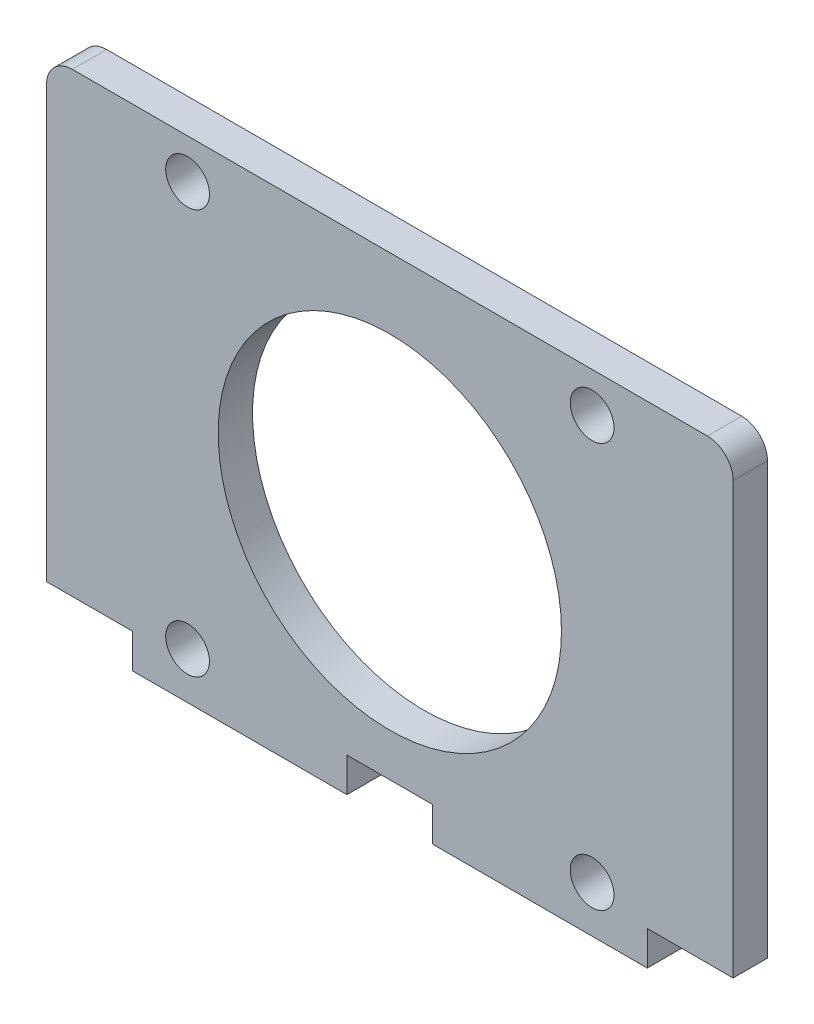
ISO-10303-21;
HEADER;
FILE_DESCRIPTION(('STEP AP214'),'2;1');
FILE_NAME('part.step','',(''),(''),'','','');
FILE_SCHEMA(('AUTOMOTIVE_DESIGN { 1 0 10303 214 1 1 1 1 }'));
ENDSEC;
DATA;
#1=APPLICATION_CONTEXT('core data for automotive mechanical design processes');
#2=APPLICATION_PROTOCOL_DEFINITION('international standard','automotive_design',2000,#1);
#3=PRODUCT_CONTEXT('',#1,'mechanical');
#4=PRODUCT('Part','Part','',(#3));
#5=PRODUCT_RELATED_PRODUCT_CATEGORY('part','',(#4));
#6=PRODUCT_DEFINITION_FORMATION('','',#4);
#7=PRODUCT_DEFINITION_CONTEXT('part definition',#1,'design');
#8=PRODUCT_DEFINITION('design','',#6,#7);
#9=PRODUCT_DEFINITION_SHAPE('','',#8);
#10=(LENGTH_UNIT() NAMED_UNIT(*) SI_UNIT(.MILLI.,.METRE.));
#11=(NAMED_UNIT(*) PLANE_ANGLE_UNIT() SI_UNIT($,.RADIAN.));
#12=(NAMED_UNIT(*) SI_UNIT($,.STERADIAN.) SOLID_ANGLE_UNIT());
#13=UNCERTAINTY_MEASURE_WITH_UNIT(LENGTH_MEASURE(1.E-05),#10,'distance_accuracy_value','');
#14=(GEOMETRIC_REPRESENTATION_CONTEXT(3) GLOBAL_UNCERTAINTY_ASSIGNED_CONTEXT((#13)) GLOBAL_UNIT_ASSIGNED_CONTEXT((#10,
#11,#12)) REPRESENTATION_CONTEXT('',''));
#15=CARTESIAN_POINT('',(0.,0.,0.));
#16=DIRECTION('',(0.,0.,1.));
#17=DIRECTION('',(1.,0.,0.));
#18=AXIS2_PLACEMENT_3D('',#15,#16,#17);
#19=CARTESIAN_POINT('',(0.,0.,4.));
#20=DIRECTION('',(0.,0.,1.));
#21=DIRECTION('',(1.,0.,0.));
#22=AXIS2_PLACEMENT_3D('',#19,#20,#21);
#23=PLANE('',#22);
#24=CARTESIAN_POINT('',(-23.5700000000001,-51.7699999999999,4.));
#25=DIRECTION('',(0.,0.,1.));
#26=DIRECTION('',(1.,0.,0.));
#27=AXIS2_PLACEMENT_3D('',#24,#25,#26);
#28=CIRCLE('',#27,2.55);
#29=CARTESIAN_POINT('',(-21.0200000000001,-51.7699999999999,4.));
#30=VERTEX_POINT('',#29);
#31=EDGE_CURVE('E484',#30,#30,#28,.T.);
#32=ORIENTED_EDGE('',*,*,#31,.F.);
#33=EDGE_LOOP('',(#32));
#34=FACE_BOUND('',#33,.T.);
#35=CARTESIAN_POINT('',(23.5700000000001,-4.63000000000012,4.));
#36=DIRECTION('',(0.,0.,1.));
#37=DIRECTION('',(1.,0.,0.));
#38=AXIS2_PLACEMENT_3D('',#35,#36,#37);
#39=CIRCLE('',#38,2.55);
#40=CARTESIAN_POINT('',(26.1200000000001,-4.63000000000012,4.));
#41=VERTEX_POINT('',#40);
#42=EDGE_CURVE('E496',#41,#41,#39,.T.);
#43=ORIENTED_EDGE('',*,*,#42,.F.);
#44=EDGE_LOOP('',(#43));
#45=FACE_BOUND('',#44,.T.);
#46=DIRECTION('',(-1.,0.,0.));
#47=VECTOR('',#46,1.);
#48=CARTESIAN_POINT('',(-40.,0.,4.));
#49=LINE('',#48,#47);
#50=CARTESIAN_POINT('',(37.,0.,4.));
#51=VERTEX_POINT('',#50);
#52=CARTESIAN_POINT('',(-37.,0.,4.));
#53=VERTEX_POINT('',#52);
#54=EDGE_CURVE('E179',#51,#53,#49,.T.);
#55=ORIENTED_EDGE('',*,*,#54,.T.);
#56=CARTESIAN_POINT('',(-37.,-3.,4.));
#57=DIRECTION('',(0.,0.,1.));
#58=DIRECTION('',(1.,0.,0.));
#59=AXIS2_PLACEMENT_3D('',#56,#57,#58);
#60=CIRCLE('',#59,3.);
#61=CARTESIAN_POINT('',(-40.,-3.,4.));
#62=VERTEX_POINT('',#61);
#63=EDGE_CURVE('E43',#53,#62,#60,.T.);
#64=ORIENTED_EDGE('',*,*,#63,.T.);
#65=DIRECTION('',(0.,-1.,0.));
#66=VECTOR('',#65,1.);
#67=CARTESIAN_POINT('',(-40.,0.,4.));
#68=LINE('',#67,#66);
#69=CARTESIAN_POINT('',(-40.,-53.2,4.));
#70=VERTEX_POINT('',#69);
#71=EDGE_CURVE('E137',#62,#70,#68,.T.);
#72=ORIENTED_EDGE('',*,*,#71,.T.);
#73=DIRECTION('',(1.,0.,0.));
#74=VECTOR('',#73,1.);
#75=CARTESIAN_POINT('',(-40.,-53.2,4.));
#76=LINE('',#75,#74);
#77=CARTESIAN_POINT('',(-30.,-53.2,4.));
#78=VERTEX_POINT('',#77);
#79=EDGE_CURVE('E140',#70,#78,#76,.T.);
#80=ORIENTED_EDGE('',*,*,#79,.T.);
#81=DIRECTION('',(0.,-1.,0.));
#82=VECTOR('',#81,1.);
#83=CARTESIAN_POINT('',(-30.,-53.2,4.));
#84=LINE('',#83,#82);
#85=CARTESIAN_POINT('',(-30.,-57.2,4.));
#86=VERTEX_POINT('',#85);
#87=EDGE_CURVE('E156',#78,#86,#84,.T.);
#88=ORIENTED_EDGE('',*,*,#87,.T.);
#89=DIRECTION('',(1.,0.,0.));
#90=VECTOR('',#89,1.);
#91=CARTESIAN_POINT('',(-30.,-57.2,4.));
#92=LINE('',#91,#90);
#93=CARTESIAN_POINT('',(-5.,-57.2,4.));
#94=VERTEX_POINT('',#93);
#95=EDGE_CURVE('E229',#86,#94,#92,.T.);
#96=ORIENTED_EDGE('',*,*,#95,.T.);
#97=DIRECTION('',(0.,1.,0.));
#98=VECTOR('',#97,1.);
#99=CARTESIAN_POINT('',(-5.,-57.2,4.));
#100=LINE('',#99,#98);
#101=CARTESIAN_POINT('',(-5.,-53.2,4.));
#102=VERTEX_POINT('',#101);
#103=EDGE_CURVE('E268',#94,#102,#100,.T.);
#104=ORIENTED_EDGE('',*,*,#103,.T.);
#105=DIRECTION('',(1.,0.,0.));
#106=VECTOR('',#105,1.);
#107=CARTESIAN_POINT('',(-5.,-53.2,4.));
#108=LINE('',#107,#106);
#109=CARTESIAN_POINT('',(5.,-53.2,4.));
#110=VERTEX_POINT('',#109);
#111=EDGE_CURVE('E272',#102,#110,#108,.T.);
#112=ORIENTED_EDGE('',*,*,#111,.T.);
#113=DIRECTION('',(0.,-1.,0.));
#114=VECTOR('',#113,1.);
#115=CARTESIAN_POINT('',(5.,-53.2,4.));
#116=LINE('',#115,#114);
#117=CARTESIAN_POINT('',(5.,-57.2,4.));
#118=VERTEX_POINT('',#117);
#119=EDGE_CURVE('E274',#110,#118,#116,.T.);
#120=ORIENTED_EDGE('',*,*,#119,.T.);
#121=DIRECTION('',(1.,0.,0.));
#122=VECTOR('',#121,1.);
#123=CARTESIAN_POINT('',(5.,-57.2,4.));
#124=LINE('',#123,#122);
#125=CARTESIAN_POINT('',(30.,-57.2,4.));
#126=VERTEX_POINT('',#125);
#127=EDGE_CURVE('E261',#118,#126,#124,.T.);
#128=ORIENTED_EDGE('',*,*,#127,.T.);
#129=DIRECTION('',(0.,1.,0.));
#130=VECTOR('',#129,1.);
#131=CARTESIAN_POINT('',(30.,-57.2,4.));
#132=LINE('',#131,#130);
#133=CARTESIAN_POINT('',(30.,-53.2,4.));
#134=VERTEX_POINT('',#133);
#135=EDGE_CURVE('E258',#126,#134,#132,.T.);
#136=ORIENTED_EDGE('',*,*,#135,.T.);
#137=DIRECTION('',(1.,0.,0.));
#138=VECTOR('',#137,1.);
#139=CARTESIAN_POINT('',(30.,-53.2,4.));
#140=LINE('',#139,#138);
#141=CARTESIAN_POINT('',(40.,-53.2,4.));
#142=VERTEX_POINT('',#141);
#143=EDGE_CURVE('E257',#134,#142,#140,.T.);
#144=ORIENTED_EDGE('',*,*,#143,.T.);
#145=DIRECTION('',(0.,1.,0.));
#146=VECTOR('',#145,1.);
#147=CARTESIAN_POINT('',(40.,-53.2,4.));
#148=LINE('',#147,#146);
#149=CARTESIAN_POINT('',(40.,-3.,4.));
#150=VERTEX_POINT('',#149);
#151=EDGE_CURVE('E180',#142,#150,#148,.T.);
#152=ORIENTED_EDGE('',*,*,#151,.T.);
#153=CARTESIAN_POINT('',(37.,-3.,4.));
#154=DIRECTION('',(0.,0.,1.));
#155=DIRECTION('',(1.,0.,0.));
#156=AXIS2_PLACEMENT_3D('',#153,#154,#155);
#157=CIRCLE('',#156,3.);
#158=EDGE_CURVE('E177',#150,#51,#157,.T.);
#159=ORIENTED_EDGE('',*,*,#158,.T.);
#160=EDGE_LOOP('',(#55,#64,#72,#80,#88,#96,#104,#112,#120,#128,#136,#144,#152,#159));
#161=FACE_BOUND('',#160,.T.);
#162=CARTESIAN_POINT('',(-23.5699999999999,-4.62999999999987,4.));
#163=DIRECTION('',(0.,0.,1.));
#164=DIRECTION('',(1.,0.,0.));
#165=AXIS2_PLACEMENT_3D('',#162,#163,#164);
#166=CIRCLE('',#165,2.55);
#167=CARTESIAN_POINT('',(-21.0199999999999,-4.62999999999987,4.));
#168=VERTEX_POINT('',#167);
#169=EDGE_CURVE('E265',#168,#168,#166,.T.);
#170=ORIENTED_EDGE('',*,*,#169,.F.);
#171=EDGE_LOOP('',(#170));
#172=FACE_BOUND('',#171,.T.);
#173=CARTESIAN_POINT('',(23.5699999999999,-51.7700000000001,4.));
#174=DIRECTION('',(0.,0.,1.));
#175=DIRECTION('',(1.,0.,0.));
#176=AXIS2_PLACEMENT_3D('',#173,#174,#175);
#177=CIRCLE('',#176,2.55);
#178=CARTESIAN_POINT('',(26.1199999999999,-51.7700000000001,4.));
#179=VERTEX_POINT('',#178);
#180=EDGE_CURVE('E490',#179,#179,#177,.T.);
#181=ORIENTED_EDGE('',*,*,#180,.F.);
#182=EDGE_LOOP('',(#181));
#183=FACE_BOUND('',#182,.T.);
#184=CARTESIAN_POINT('',(0.,-28.2,4.));
#185=DIRECTION('',(0.,0.,1.));
#186=DIRECTION('',(1.,0.,0.));
#187=AXIS2_PLACEMENT_3D('',#184,#185,#186);
#188=CIRCLE('',#187,20.);
#189=CARTESIAN_POINT('',(20.,-28.2,4.));
#190=VERTEX_POINT('',#189);
#191=EDGE_CURVE('E475',#190,#190,#188,.T.);
#192=ORIENTED_EDGE('',*,*,#191,.F.);
#193=EDGE_LOOP('',(#192));
#194=FACE_BOUND('',#193,.T.);
#195=ADVANCED_FACE('F35',(#34,#45,#161,#172,#183,#194),#23,.T.);
#196=CARTESIAN_POINT('',(0.,0.,0.));
#197=DIRECTION('',(0.,0.,1.));
#198=DIRECTION('',(1.,0.,0.));
#199=AXIS2_PLACEMENT_3D('',#196,#197,#198);
#200=PLANE('',#199);
#201=DIRECTION('',(0.,-1.,0.));
#202=VECTOR('',#201,1.);
#203=CARTESIAN_POINT('',(-40.,0.,0.));
#204=LINE('',#203,#202);
#205=CARTESIAN_POINT('',(-40.,-3.,0.));
#206=VERTEX_POINT('',#205);
#207=CARTESIAN_POINT('',(-40.,-53.2,0.));
#208=VERTEX_POINT('',#207);
#209=EDGE_CURVE('E160',#206,#208,#204,.T.);
#210=ORIENTED_EDGE('',*,*,#209,.F.);
#211=CARTESIAN_POINT('',(-37.,-3.,0.));
#212=DIRECTION('',(0.,0.,1.));
#213=DIRECTION('',(1.,0.,0.));
#214=AXIS2_PLACEMENT_3D('',#211,#212,#213);
#215=CIRCLE('',#214,3.);
#216=CARTESIAN_POINT('',(-37.,0.,0.));
#217=VERTEX_POINT('',#216);
#218=EDGE_CURVE('E171',#206,#217,#215,.F.);
#219=ORIENTED_EDGE('',*,*,#218,.T.);
#220=DIRECTION('',(-1.,0.,0.));
#221=VECTOR('',#220,1.);
#222=CARTESIAN_POINT('',(-40.,0.,0.));
#223=LINE('',#222,#221);
#224=CARTESIAN_POINT('',(37.,0.,0.));
#225=VERTEX_POINT('',#224);
#226=EDGE_CURVE('E147',#225,#217,#223,.T.);
#227=ORIENTED_EDGE('',*,*,#226,.F.);
#228=CARTESIAN_POINT('',(37.,-3.,0.));
#229=DIRECTION('',(0.,0.,1.));
#230=DIRECTION('',(1.,0.,0.));
#231=AXIS2_PLACEMENT_3D('',#228,#229,#230);
#232=CIRCLE('',#231,3.);
#233=CARTESIAN_POINT('',(40.,-3.,0.));
#234=VERTEX_POINT('',#233);
#235=EDGE_CURVE('E164',#225,#234,#232,.F.);
#236=ORIENTED_EDGE('',*,*,#235,.T.);
#237=DIRECTION('',(0.,1.,0.));
#238=VECTOR('',#237,1.);
#239=CARTESIAN_POINT('',(40.,-53.2,0.));
#240=LINE('',#239,#238);
#241=CARTESIAN_POINT('',(40.,-53.2,0.));
#242=VERTEX_POINT('',#241);
#243=EDGE_CURVE('E192',#242,#234,#240,.T.);
#244=ORIENTED_EDGE('',*,*,#243,.F.);
#245=DIRECTION('',(1.,0.,0.));
#246=VECTOR('',#245,1.);
#247=CARTESIAN_POINT('',(30.,-53.2,0.));
#248=LINE('',#247,#246);
#249=CARTESIAN_POINT('',(30.,-53.2,0.));
#250=VERTEX_POINT('',#249);
#251=EDGE_CURVE('E196',#250,#242,#248,.T.);
#252=ORIENTED_EDGE('',*,*,#251,.F.);
#253=DIRECTION('',(0.,1.,0.));
#254=VECTOR('',#253,1.);
#255=CARTESIAN_POINT('',(30.,-57.2,0.));
#256=LINE('',#255,#254);
#257=CARTESIAN_POINT('',(30.,-57.2,0.));
#258=VERTEX_POINT('',#257);
#259=EDGE_CURVE('E199',#258,#250,#256,.T.);
#260=ORIENTED_EDGE('',*,*,#259,.F.);
#261=DIRECTION('',(1.,0.,0.));
#262=VECTOR('',#261,1.);
#263=CARTESIAN_POINT('',(5.,-57.2,0.));
#264=LINE('',#263,#262);
#265=CARTESIAN_POINT('',(5.,-57.2,0.));
#266=VERTEX_POINT('',#265);
#267=EDGE_CURVE('E246',#266,#258,#264,.T.);
#268=ORIENTED_EDGE('',*,*,#267,.F.);
#269=DIRECTION('',(0.,-1.,0.));
#270=VECTOR('',#269,1.);
#271=CARTESIAN_POINT('',(5.,-53.2,0.));
#272=LINE('',#271,#270);
#273=CARTESIAN_POINT('',(5.,-53.2,0.));
#274=VERTEX_POINT('',#273);
#275=EDGE_CURVE('E244',#274,#266,#272,.T.);
#276=ORIENTED_EDGE('',*,*,#275,.F.);
#277=DIRECTION('',(1.,0.,0.));
#278=VECTOR('',#277,1.);
#279=CARTESIAN_POINT('',(-5.,-53.2,0.));
#280=LINE('',#279,#278);
#281=CARTESIAN_POINT('',(-5.,-53.2,0.));
#282=VERTEX_POINT('',#281);
#283=EDGE_CURVE('E237',#282,#274,#280,.T.);
#284=ORIENTED_EDGE('',*,*,#283,.F.);
#285=DIRECTION('',(0.,1.,0.));
#286=VECTOR('',#285,1.);
#287=CARTESIAN_POINT('',(-5.,-57.2,0.));
#288=LINE('',#287,#286);
#289=CARTESIAN_POINT('',(-5.,-57.2,0.));
#290=VERTEX_POINT('',#289);
#291=EDGE_CURVE('E235',#290,#282,#288,.T.);
#292=ORIENTED_EDGE('',*,*,#291,.F.);
#293=DIRECTION('',(1.,0.,0.));
#294=VECTOR('',#293,1.);
#295=CARTESIAN_POINT('',(-30.,-57.2,0.));
#296=LINE('',#295,#294);
#297=CARTESIAN_POINT('',(-30.,-57.2,0.));
#298=VERTEX_POINT('',#297);
#299=EDGE_CURVE('E228',#298,#290,#296,.T.);
#300=ORIENTED_EDGE('',*,*,#299,.F.);
#301=DIRECTION('',(0.,-1.,0.));
#302=VECTOR('',#301,1.);
#303=CARTESIAN_POINT('',(-30.,-53.2,0.));
#304=LINE('',#303,#302);
#305=CARTESIAN_POINT('',(-30.,-53.2,0.));
#306=VERTEX_POINT('',#305);
#307=EDGE_CURVE('E233',#306,#298,#304,.T.);
#308=ORIENTED_EDGE('',*,*,#307,.F.);
#309=DIRECTION('',(1.,0.,0.));
#310=VECTOR('',#309,1.);
#311=CARTESIAN_POINT('',(-40.,-53.2,0.));
#312=LINE('',#311,#310);
#313=EDGE_CURVE('E239',#208,#306,#312,.T.);
#314=ORIENTED_EDGE('',*,*,#313,.F.);
#315=EDGE_LOOP('',(#210,#219,#227,#236,#244,#252,#260,#268,#276,#284,#292,#300,#308,#314));
#316=FACE_BOUND('',#315,.T.);
#317=CARTESIAN_POINT('',(-23.5699999999999,-4.62999999999987,0.));
#318=DIRECTION('',(0.,0.,1.));
#319=DIRECTION('',(1.,0.,0.));
#320=AXIS2_PLACEMENT_3D('',#317,#318,#319);
#321=CIRCLE('',#320,2.55);
#322=CARTESIAN_POINT('',(-21.0199999999999,-4.62999999999987,0.));
#323=VERTEX_POINT('',#322);
#324=EDGE_CURVE('E499',#323,#323,#321,.T.);
#325=ORIENTED_EDGE('',*,*,#324,.T.);
#326=EDGE_LOOP('',(#325));
#327=FACE_BOUND('',#326,.T.);
#328=CARTESIAN_POINT('',(23.5700000000001,-4.63000000000012,0.));
#329=DIRECTION('',(0.,0.,1.));
#330=DIRECTION('',(1.,0.,0.));
#331=AXIS2_PLACEMENT_3D('',#328,#329,#330);
#332=CIRCLE('',#331,2.55);
#333=CARTESIAN_POINT('',(26.1200000000001,-4.63000000000012,0.));
#334=VERTEX_POINT('',#333);
#335=EDGE_CURVE('E493',#334,#334,#332,.T.);
#336=ORIENTED_EDGE('',*,*,#335,.T.);
#337=EDGE_LOOP('',(#336));
#338=FACE_BOUND('',#337,.T.);
#339=CARTESIAN_POINT('',(23.5699999999999,-51.7700000000001,0.));
#340=DIRECTION('',(0.,0.,1.));
#341=DIRECTION('',(1.,0.,0.));
#342=AXIS2_PLACEMENT_3D('',#339,#340,#341);
#343=CIRCLE('',#342,2.55);
#344=CARTESIAN_POINT('',(26.1199999999999,-51.7700000000001,0.));
#345=VERTEX_POINT('',#344);
#346=EDGE_CURVE('E487',#345,#345,#343,.T.);
#347=ORIENTED_EDGE('',*,*,#346,.T.);
#348=EDGE_LOOP('',(#347));
#349=FACE_BOUND('',#348,.T.);
#350=CARTESIAN_POINT('',(-23.5700000000001,-51.7699999999999,0.));
#351=DIRECTION('',(0.,0.,1.));
#352=DIRECTION('',(1.,0.,0.));
#353=AXIS2_PLACEMENT_3D('',#350,#351,#352);
#354=CIRCLE('',#353,2.55);
#355=CARTESIAN_POINT('',(-21.0200000000001,-51.7699999999999,0.));
#356=VERTEX_POINT('',#355);
#357=EDGE_CURVE('E481',#356,#356,#354,.T.);
#358=ORIENTED_EDGE('',*,*,#357,.T.);
#359=EDGE_LOOP('',(#358));
#360=FACE_BOUND('',#359,.T.);
#361=CARTESIAN_POINT('',(0.,-28.2,0.));
#362=DIRECTION('',(0.,0.,1.));
#363=DIRECTION('',(1.,0.,0.));
#364=AXIS2_PLACEMENT_3D('',#361,#362,#363);
#365=CIRCLE('',#364,20.);
#366=CARTESIAN_POINT('',(20.,-28.2,0.));
#367=VERTEX_POINT('',#366);
#368=EDGE_CURVE('E478',#367,#367,#365,.T.);
#369=ORIENTED_EDGE('',*,*,#368,.T.);
#370=EDGE_LOOP('',(#369));
#371=FACE_BOUND('',#370,.T.);
#372=ADVANCED_FACE('F189',(#316,#327,#338,#349,#360,#371),#200,.F.);
#373=CARTESIAN_POINT('',(-40.,0.,4.));
#374=DIRECTION('',(1.,0.,0.));
#375=DIRECTION('',(0.,1.,0.));
#376=AXIS2_PLACEMENT_3D('',#373,#374,#375);
#377=PLANE('',#376);
#378=ORIENTED_EDGE('',*,*,#71,.F.);
#379=DIRECTION('',(0.,0.,-1.));
#380=VECTOR('',#379,1.);
#381=CARTESIAN_POINT('',(-40.,-3.,4.));
#382=LINE('',#381,#380);
#383=EDGE_CURVE('E162',#62,#206,#382,.T.);
#384=ORIENTED_EDGE('',*,*,#383,.T.);
#385=ORIENTED_EDGE('',*,*,#209,.T.);
#386=DIRECTION('',(0.,0.,-1.));
#387=VECTOR('',#386,1.);
#388=CARTESIAN_POINT('',(-40.,-53.2,4.));
#389=LINE('',#388,#387);
#390=EDGE_CURVE('E152',#70,#208,#389,.T.);
#391=ORIENTED_EDGE('',*,*,#390,.F.);
#392=EDGE_LOOP('',(#378,#384,#385,#391));
#393=FACE_BOUND('',#392,.T.);
#394=ADVANCED_FACE('F158',(#393),#377,.F.);
#395=CARTESIAN_POINT('',(-40.,-53.2,4.));
#396=DIRECTION('',(0.,1.,0.));
#397=DIRECTION('',(0.,0.,1.));
#398=AXIS2_PLACEMENT_3D('',#395,#396,#397);
#399=PLANE('',#398);
#400=ORIENTED_EDGE('',*,*,#313,.T.);
#401=DIRECTION('',(0.,0.,-1.));
#402=VECTOR('',#401,1.);
#403=CARTESIAN_POINT('',(-30.,-53.2,4.));
#404=LINE('',#403,#402);
#405=EDGE_CURVE('E154',#78,#306,#404,.T.);
#406=ORIENTED_EDGE('',*,*,#405,.F.);
#407=ORIENTED_EDGE('',*,*,#79,.F.);
#408=ORIENTED_EDGE('',*,*,#390,.T.);
#409=EDGE_LOOP('',(#400,#406,#407,#408));
#410=FACE_BOUND('',#409,.T.);
#411=ADVANCED_FACE('F151',(#410),#399,.F.);
#412=CARTESIAN_POINT('',(-30.,-53.2,4.));
#413=DIRECTION('',(1.,0.,0.));
#414=DIRECTION('',(0.,1.,0.));
#415=AXIS2_PLACEMENT_3D('',#412,#413,#414);
#416=PLANE('',#415);
#417=ORIENTED_EDGE('',*,*,#307,.T.);
#418=DIRECTION('',(0.,0.,-1.));
#419=VECTOR('',#418,1.);
#420=CARTESIAN_POINT('',(-30.,-57.2,4.));
#421=LINE('',#420,#419);
#422=EDGE_CURVE('E166',#86,#298,#421,.T.);
#423=ORIENTED_EDGE('',*,*,#422,.F.);
#424=ORIENTED_EDGE('',*,*,#87,.F.);
#425=ORIENTED_EDGE('',*,*,#405,.T.);
#426=EDGE_LOOP('',(#417,#423,#424,#425));
#427=FACE_BOUND('',#426,.T.);
#428=ADVANCED_FACE('F266',(#427),#416,.F.);
#429=CARTESIAN_POINT('',(-30.,-57.2,4.));
#430=DIRECTION('',(0.,1.,0.));
#431=DIRECTION('',(0.,0.,1.));
#432=AXIS2_PLACEMENT_3D('',#429,#430,#431);
#433=PLANE('',#432);
#434=ORIENTED_EDGE('',*,*,#299,.T.);
#435=DIRECTION('',(0.,0.,-1.));
#436=VECTOR('',#435,1.);
#437=CARTESIAN_POINT('',(-5.,-57.2,4.));
#438=LINE('',#437,#436);
#439=EDGE_CURVE('E219',#94,#290,#438,.T.);
#440=ORIENTED_EDGE('',*,*,#439,.F.);
#441=ORIENTED_EDGE('',*,*,#95,.F.);
#442=ORIENTED_EDGE('',*,*,#422,.T.);
#443=EDGE_LOOP('',(#434,#440,#441,#442));
#444=FACE_BOUND('',#443,.T.);
#445=ADVANCED_FACE('F226',(#444),#433,.F.);
#446=CARTESIAN_POINT('',(-5.,-57.2,4.));
#447=DIRECTION('',(-1.,0.,0.));
#448=DIRECTION('',(0.,0.,1.));
#449=AXIS2_PLACEMENT_3D('',#446,#447,#448);
#450=PLANE('',#449);
#451=ORIENTED_EDGE('',*,*,#291,.T.);
#452=DIRECTION('',(0.,0.,-1.));
#453=VECTOR('',#452,1.);
#454=CARTESIAN_POINT('',(-5.,-53.2,4.));
#455=LINE('',#454,#453);
#456=EDGE_CURVE('E216',#102,#282,#455,.T.);
#457=ORIENTED_EDGE('',*,*,#456,.F.);
#458=ORIENTED_EDGE('',*,*,#103,.F.);
#459=ORIENTED_EDGE('',*,*,#439,.T.);
#460=EDGE_LOOP('',(#451,#457,#458,#459));
#461=FACE_BOUND('',#460,.T.);
#462=ADVANCED_FACE('F290',(#461),#450,.F.);
#463=CARTESIAN_POINT('',(-5.,-53.2,4.));
#464=DIRECTION('',(0.,1.,0.));
#465=DIRECTION('',(0.,0.,1.));
#466=AXIS2_PLACEMENT_3D('',#463,#464,#465);
#467=PLANE('',#466);
#468=ORIENTED_EDGE('',*,*,#283,.T.);
#469=DIRECTION('',(0.,0.,-1.));
#470=VECTOR('',#469,1.);
#471=CARTESIAN_POINT('',(5.,-53.2,4.));
#472=LINE('',#471,#470);
#473=EDGE_CURVE('E213',#110,#274,#472,.T.);
#474=ORIENTED_EDGE('',*,*,#473,.F.);
#475=ORIENTED_EDGE('',*,*,#111,.F.);
#476=ORIENTED_EDGE('',*,*,#456,.T.);
#477=EDGE_LOOP('',(#468,#474,#475,#476));
#478=FACE_BOUND('',#477,.T.);
#479=ADVANCED_FACE('F286',(#478),#467,.F.);
#480=CARTESIAN_POINT('',(5.,-53.2,4.));
#481=DIRECTION('',(1.,0.,0.));
#482=DIRECTION('',(0.,1.,0.));
#483=AXIS2_PLACEMENT_3D('',#480,#481,#482);
#484=PLANE('',#483);
#485=ORIENTED_EDGE('',*,*,#275,.T.);
#486=DIRECTION('',(0.,0.,-1.));
#487=VECTOR('',#486,1.);
#488=CARTESIAN_POINT('',(5.,-57.2,4.));
#489=LINE('',#488,#487);
#490=EDGE_CURVE('E210',#118,#266,#489,.T.);
#491=ORIENTED_EDGE('',*,*,#490,.F.);
#492=ORIENTED_EDGE('',*,*,#119,.F.);
#493=ORIENTED_EDGE('',*,*,#473,.T.);
#494=EDGE_LOOP('',(#485,#491,#492,#493));
#495=FACE_BOUND('',#494,.T.);
#496=ADVANCED_FACE('F282',(#495),#484,.F.);
#497=CARTESIAN_POINT('',(5.,-57.2,4.));
#498=DIRECTION('',(0.,1.,0.));
#499=DIRECTION('',(0.,0.,1.));
#500=AXIS2_PLACEMENT_3D('',#497,#498,#499);
#501=PLANE('',#500);
#502=ORIENTED_EDGE('',*,*,#267,.T.);
#503=DIRECTION('',(0.,0.,-1.));
#504=VECTOR('',#503,1.);
#505=CARTESIAN_POINT('',(30.,-57.2,4.));
#506=LINE('',#505,#504);
#507=EDGE_CURVE('E207',#126,#258,#506,.T.);
#508=ORIENTED_EDGE('',*,*,#507,.F.);
#509=ORIENTED_EDGE('',*,*,#127,.F.);
#510=ORIENTED_EDGE('',*,*,#490,.T.);
#511=EDGE_LOOP('',(#502,#508,#509,#510));
#512=FACE_BOUND('',#511,.T.);
#513=ADVANCED_FACE('F279',(#512),#501,.F.);
#514=CARTESIAN_POINT('',(30.,-57.2,4.));
#515=DIRECTION('',(-1.,0.,0.));
#516=DIRECTION('',(0.,-1.,0.));
#517=AXIS2_PLACEMENT_3D('',#514,#515,#516);
#518=PLANE('',#517);
#519=ORIENTED_EDGE('',*,*,#259,.T.);
#520=DIRECTION('',(0.,0.,-1.));
#521=VECTOR('',#520,1.);
#522=CARTESIAN_POINT('',(30.,-53.2,4.));
#523=LINE('',#522,#521);
#524=EDGE_CURVE('E204',#134,#250,#523,.T.);
#525=ORIENTED_EDGE('',*,*,#524,.F.);
#526=ORIENTED_EDGE('',*,*,#135,.F.);
#527=ORIENTED_EDGE('',*,*,#507,.T.);
#528=EDGE_LOOP('',(#519,#525,#526,#527));
#529=FACE_BOUND('',#528,.T.);
#530=ADVANCED_FACE('F250',(#529),#518,.F.);
#531=CARTESIAN_POINT('',(30.,-53.2,4.));
#532=DIRECTION('',(0.,1.,0.));
#533=DIRECTION('',(0.,0.,1.));
#534=AXIS2_PLACEMENT_3D('',#531,#532,#533);
#535=PLANE('',#534);
#536=ORIENTED_EDGE('',*,*,#251,.T.);
#537=DIRECTION('',(0.,0.,-1.));
#538=VECTOR('',#537,1.);
#539=CARTESIAN_POINT('',(40.,-53.2,4.));
#540=LINE('',#539,#538);
#541=EDGE_CURVE('E185',#142,#242,#540,.T.);
#542=ORIENTED_EDGE('',*,*,#541,.F.);
#543=ORIENTED_EDGE('',*,*,#143,.F.);
#544=ORIENTED_EDGE('',*,*,#524,.T.);
#545=EDGE_LOOP('',(#536,#542,#543,#544));
#546=FACE_BOUND('',#545,.T.);
#547=ADVANCED_FACE('F256',(#546),#535,.F.);
#548=CARTESIAN_POINT('',(40.,-53.2,4.));
#549=DIRECTION('',(-1.,0.,0.));
#550=DIRECTION('',(0.,-1.,0.));
#551=AXIS2_PLACEMENT_3D('',#548,#549,#550);
#552=PLANE('',#551);
#553=ORIENTED_EDGE('',*,*,#243,.T.);
#554=DIRECTION('',(0.,0.,-1.));
#555=VECTOR('',#554,1.);
#556=CARTESIAN_POINT('',(40.,-3.,4.));
#557=LINE('',#556,#555);
#558=EDGE_CURVE('E11',#234,#150,#557,.F.);
#559=ORIENTED_EDGE('',*,*,#558,.T.);
#560=ORIENTED_EDGE('',*,*,#151,.F.);
#561=ORIENTED_EDGE('',*,*,#541,.T.);
#562=EDGE_LOOP('',(#553,#559,#560,#561));
#563=FACE_BOUND('',#562,.T.);
#564=ADVANCED_FACE('F194',(#563),#552,.F.);
#565=CARTESIAN_POINT('',(-40.,0.,4.));
#566=DIRECTION('',(0.,-1.,0.));
#567=DIRECTION('',(0.,0.,-1.));
#568=AXIS2_PLACEMENT_3D('',#565,#566,#567);
#569=PLANE('',#568);
#570=ORIENTED_EDGE('',*,*,#226,.T.);
#571=DIRECTION('',(0.,0.,-1.));
#572=VECTOR('',#571,1.);
#573=CARTESIAN_POINT('',(-37.,0.,4.));
#574=LINE('',#573,#572);
#575=EDGE_CURVE('E56',#217,#53,#574,.F.);
#576=ORIENTED_EDGE('',*,*,#575,.T.);
#577=ORIENTED_EDGE('',*,*,#54,.F.);
#578=DIRECTION('',(0.,0.,-1.));
#579=VECTOR('',#578,1.);
#580=CARTESIAN_POINT('',(37.,0.,4.));
#581=LINE('',#580,#579);
#582=EDGE_CURVE('E173',#51,#225,#581,.T.);
#583=ORIENTED_EDGE('',*,*,#582,.T.);
#584=EDGE_LOOP('',(#570,#576,#577,#583));
#585=FACE_BOUND('',#584,.T.);
#586=ADVANCED_FACE('F183',(#585),#569,.F.);
#587=CARTESIAN_POINT('',(-23.5699999999999,-4.62999999999987,4.));
#588=DIRECTION('',(0.,0.,-1.));
#589=DIRECTION('',(-1.,0.,0.));
#590=AXIS2_PLACEMENT_3D('',#587,#588,#589);
#591=CYLINDRICAL_SURFACE('',#590,2.55);
#592=ORIENTED_EDGE('',*,*,#169,.T.);
#593=EDGE_LOOP('',(#592));
#594=FACE_BOUND('',#593,.T.);
#595=ORIENTED_EDGE('',*,*,#324,.F.);
#596=EDGE_LOOP('',(#595));
#597=FACE_BOUND('',#596,.T.);
#598=ADVANCED_FACE('F309',(#594,#597),#591,.F.);
#599=CARTESIAN_POINT('',(23.5700000000001,-4.63000000000012,4.));
#600=DIRECTION('',(0.,0.,-1.));
#601=DIRECTION('',(-1.,0.,0.));
#602=AXIS2_PLACEMENT_3D('',#599,#600,#601);
#603=CYLINDRICAL_SURFACE('',#602,2.55);
#604=ORIENTED_EDGE('',*,*,#42,.T.);
#605=EDGE_LOOP('',(#604));
#606=FACE_BOUND('',#605,.T.);
#607=ORIENTED_EDGE('',*,*,#335,.F.);
#608=EDGE_LOOP('',(#607));
#609=FACE_BOUND('',#608,.T.);
#610=ADVANCED_FACE('F355',(#606,#609),#603,.F.);
#611=CARTESIAN_POINT('',(23.5699999999999,-51.7700000000001,4.));
#612=DIRECTION('',(0.,0.,-1.));
#613=DIRECTION('',(-1.,0.,0.));
#614=AXIS2_PLACEMENT_3D('',#611,#612,#613);
#615=CYLINDRICAL_SURFACE('',#614,2.55);
#616=ORIENTED_EDGE('',*,*,#180,.T.);
#617=EDGE_LOOP('',(#616));
#618=FACE_BOUND('',#617,.T.);
#619=ORIENTED_EDGE('',*,*,#346,.F.);
#620=EDGE_LOOP('',(#619));
#621=FACE_BOUND('',#620,.T.);
#622=ADVANCED_FACE('F362',(#618,#621),#615,.F.);
#623=CARTESIAN_POINT('',(-23.5700000000001,-51.7699999999999,4.));
#624=DIRECTION('',(0.,0.,-1.));
#625=DIRECTION('',(-1.,0.,0.));
#626=AXIS2_PLACEMENT_3D('',#623,#624,#625);
#627=CYLINDRICAL_SURFACE('',#626,2.55);
#628=ORIENTED_EDGE('',*,*,#31,.T.);
#629=EDGE_LOOP('',(#628));
#630=FACE_BOUND('',#629,.T.);
#631=ORIENTED_EDGE('',*,*,#357,.F.);
#632=EDGE_LOOP('',(#631));
#633=FACE_BOUND('',#632,.T.);
#634=ADVANCED_FACE('F369',(#630,#633),#627,.F.);
#635=CARTESIAN_POINT('',(0.,-28.2,4.));
#636=DIRECTION('',(0.,0.,-1.));
#637=DIRECTION('',(-1.,0.,0.));
#638=AXIS2_PLACEMENT_3D('',#635,#636,#637);
#639=CYLINDRICAL_SURFACE('',#638,20.);
#640=ORIENTED_EDGE('',*,*,#191,.T.);
#641=EDGE_LOOP('',(#640));
#642=FACE_BOUND('',#641,.T.);
#643=ORIENTED_EDGE('',*,*,#368,.F.);
#644=EDGE_LOOP('',(#643));
#645=FACE_BOUND('',#644,.T.);
#646=ADVANCED_FACE('F377',(#642,#645),#639,.F.);
#647=CARTESIAN_POINT('',(-37.,-3.,4.));
#648=DIRECTION('',(0.,0.,-1.));
#649=DIRECTION('',(-1.,0.,0.));
#650=AXIS2_PLACEMENT_3D('',#647,#648,#649);
#651=CYLINDRICAL_SURFACE('',#650,3.);
#652=ORIENTED_EDGE('',*,*,#63,.F.);
#653=ORIENTED_EDGE('',*,*,#575,.F.);
#654=ORIENTED_EDGE('',*,*,#218,.F.);
#655=ORIENTED_EDGE('',*,*,#383,.F.);
#656=EDGE_LOOP('',(#652,#653,#654,#655));
#657=FACE_BOUND('',#656,.T.);
#658=ADVANCED_FACE('F385',(#657),#651,.T.);
#659=CARTESIAN_POINT('',(37.,-3.,4.));
#660=DIRECTION('',(0.,0.,-1.));
#661=DIRECTION('',(-1.,0.,0.));
#662=AXIS2_PLACEMENT_3D('',#659,#660,#661);
#663=CYLINDRICAL_SURFACE('',#662,3.);
#664=ORIENTED_EDGE('',*,*,#158,.F.);
#665=ORIENTED_EDGE('',*,*,#558,.F.);
#666=ORIENTED_EDGE('',*,*,#235,.F.);
#667=ORIENTED_EDGE('',*,*,#582,.F.);
#668=EDGE_LOOP('',(#664,#665,#666,#667));
#669=FACE_BOUND('',#668,.T.);
#670=ADVANCED_FACE('F37',(#669),#663,.T.);
#671=CLOSED_SHELL('',(#195,#372,#394,#411,#428,#445,#462,#479,#496,#513,#530,#547,#564,#586,
#598,#610,#622,#634,#646,#658,#670));
#672=MANIFOLD_SOLID_BREP('B2',#671);
#673=ADVANCED_BREP_SHAPE_REPRESENTATION('',(#18,#672),#14);
#674=SHAPE_DEFINITION_REPRESENTATION(#9,#673);
ENDSEC;
END-ISO-10303-21;
